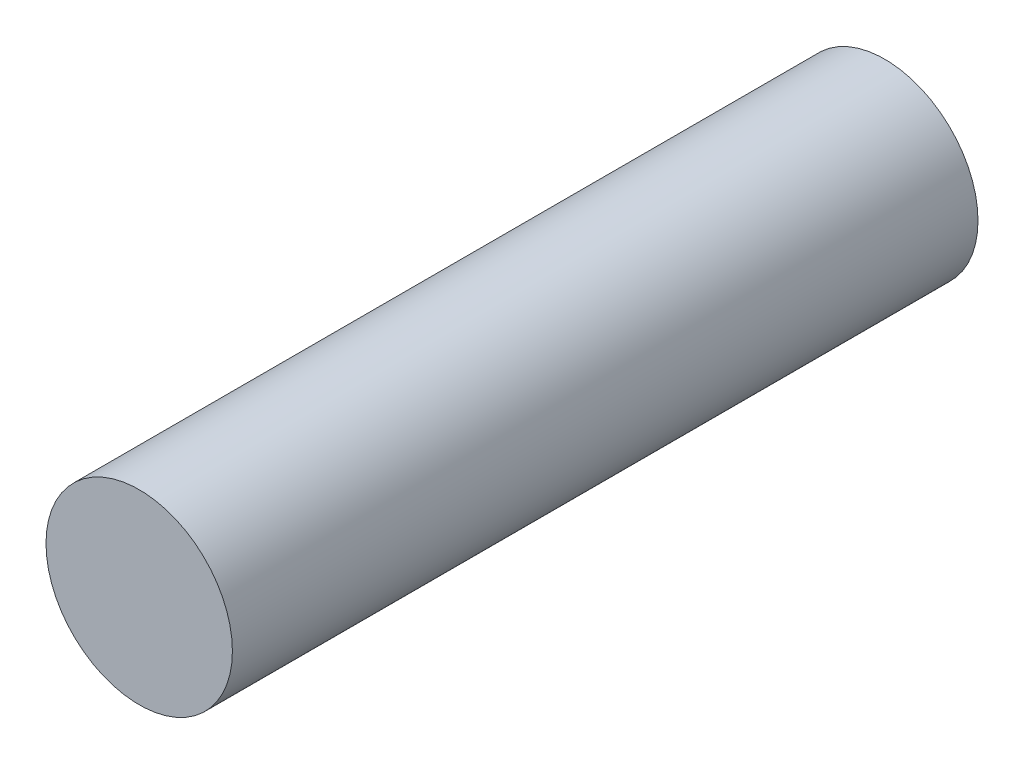
ISO-10303-21;
HEADER;
FILE_DESCRIPTION(('STEP AP214'),'2;1');
FILE_NAME('part.step','',(''),(''),'','','');
FILE_SCHEMA(('AUTOMOTIVE_DESIGN { 1 0 10303 214 1 1 1 1 }'));
ENDSEC;
DATA;
#1=APPLICATION_CONTEXT('core data for automotive mechanical design processes');
#2=APPLICATION_PROTOCOL_DEFINITION('international standard','automotive_design',2000,#1);
#3=PRODUCT_CONTEXT('',#1,'mechanical');
#4=PRODUCT('Part','Part','',(#3));
#5=PRODUCT_RELATED_PRODUCT_CATEGORY('part','',(#4));
#6=PRODUCT_DEFINITION_FORMATION('','',#4);
#7=PRODUCT_DEFINITION_CONTEXT('part definition',#1,'design');
#8=PRODUCT_DEFINITION('design','',#6,#7);
#9=PRODUCT_DEFINITION_SHAPE('','',#8);
#10=(LENGTH_UNIT() NAMED_UNIT(*) SI_UNIT(.MILLI.,.METRE.));
#11=(NAMED_UNIT(*) PLANE_ANGLE_UNIT() SI_UNIT($,.RADIAN.));
#12=(NAMED_UNIT(*) SI_UNIT($,.STERADIAN.) SOLID_ANGLE_UNIT());
#13=UNCERTAINTY_MEASURE_WITH_UNIT(LENGTH_MEASURE(1.E-05),#10,'distance_accuracy_value','');
#14=(GEOMETRIC_REPRESENTATION_CONTEXT(3) GLOBAL_UNCERTAINTY_ASSIGNED_CONTEXT((#13)) GLOBAL_UNIT_ASSIGNED_CONTEXT((#10,
#11,#12)) REPRESENTATION_CONTEXT('',''));
#15=CARTESIAN_POINT('',(0.,0.,0.));
#16=DIRECTION('',(0.,0.,1.));
#17=DIRECTION('',(1.,0.,0.));
#18=AXIS2_PLACEMENT_3D('',#15,#16,#17);
#19=CARTESIAN_POINT('',(0.,0.,40.));
#20=DIRECTION('',(0.,0.,-1.));
#21=DIRECTION('',(-1.,0.,0.));
#22=AXIS2_PLACEMENT_3D('',#19,#20,#21);
#23=CYLINDRICAL_SURFACE('',#22,5.);
#24=CARTESIAN_POINT('',(0.,0.,40.));
#25=DIRECTION('',(0.,0.,1.));
#26=DIRECTION('',(1.,0.,0.));
#27=AXIS2_PLACEMENT_3D('',#24,#25,#26);
#28=CIRCLE('',#27,5.);
#29=CARTESIAN_POINT('',(5.,0.,40.));
#30=VERTEX_POINT('',#29);
#31=EDGE_CURVE('E10',#30,#30,#28,.T.);
#32=ORIENTED_EDGE('',*,*,#31,.F.);
#33=EDGE_LOOP('',(#32));
#34=FACE_BOUND('',#33,.T.);
#35=CARTESIAN_POINT('',(0.,0.,0.));
#36=DIRECTION('',(0.,0.,1.));
#37=DIRECTION('',(1.,0.,0.));
#38=AXIS2_PLACEMENT_3D('',#35,#36,#37);
#39=CIRCLE('',#38,5.);
#40=CARTESIAN_POINT('',(5.,0.,0.));
#41=VERTEX_POINT('',#40);
#42=EDGE_CURVE('E32',#41,#41,#39,.T.);
#43=ORIENTED_EDGE('',*,*,#42,.T.);
#44=EDGE_LOOP('',(#43));
#45=FACE_BOUND('',#44,.T.);
#46=ADVANCED_FACE('F29',(#34,#45),#23,.T.);
#47=CARTESIAN_POINT('',(0.,0.,40.));
#48=DIRECTION('',(0.,0.,1.));
#49=DIRECTION('',(1.,0.,0.));
#50=AXIS2_PLACEMENT_3D('',#47,#48,#49);
#51=PLANE('',#50);
#52=ORIENTED_EDGE('',*,*,#31,.T.);
#53=EDGE_LOOP('',(#52));
#54=FACE_BOUND('',#53,.T.);
#55=ADVANCED_FACE('F44',(#54),#51,.T.);
#56=CARTESIAN_POINT('',(0.,0.,0.));
#57=DIRECTION('',(0.,0.,1.));
#58=DIRECTION('',(1.,0.,0.));
#59=AXIS2_PLACEMENT_3D('',#56,#57,#58);
#60=PLANE('',#59);
#61=ORIENTED_EDGE('',*,*,#42,.F.);
#62=EDGE_LOOP('',(#61));
#63=FACE_BOUND('',#62,.T.);
#64=ADVANCED_FACE('F42',(#63),#60,.F.);
#65=CLOSED_SHELL('',(#46,#55,#64));
#66=MANIFOLD_SOLID_BREP('B2',#65);
#67=ADVANCED_BREP_SHAPE_REPRESENTATION('',(#18,#66),#14);
#68=SHAPE_DEFINITION_REPRESENTATION(#9,#67);
ENDSEC;
END-ISO-10303-21;
